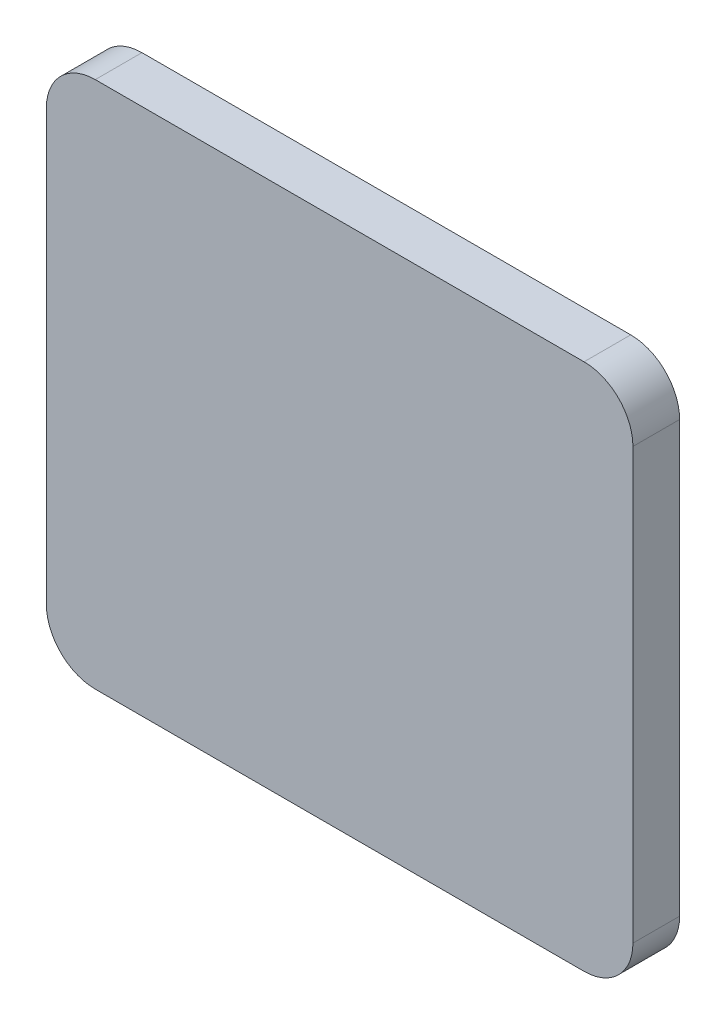
ISO-10303-21;
HEADER;
FILE_DESCRIPTION(('STEP AP214'),'2;1');
FILE_NAME('part.step','',(''),(''),'','','');
FILE_SCHEMA(('AUTOMOTIVE_DESIGN { 1 0 10303 214 1 1 1 1 }'));
ENDSEC;
DATA;
#1=APPLICATION_CONTEXT('core data for automotive mechanical design processes');
#2=APPLICATION_PROTOCOL_DEFINITION('international standard','automotive_design',2000,#1);
#3=PRODUCT_CONTEXT('',#1,'mechanical');
#4=PRODUCT('Part','Part','',(#3));
#5=PRODUCT_RELATED_PRODUCT_CATEGORY('part','',(#4));
#6=PRODUCT_DEFINITION_FORMATION('','',#4);
#7=PRODUCT_DEFINITION_CONTEXT('part definition',#1,'design');
#8=PRODUCT_DEFINITION('design','',#6,#7);
#9=PRODUCT_DEFINITION_SHAPE('','',#8);
#10=(LENGTH_UNIT() NAMED_UNIT(*) SI_UNIT(.MILLI.,.METRE.));
#11=(NAMED_UNIT(*) PLANE_ANGLE_UNIT() SI_UNIT($,.RADIAN.));
#12=(NAMED_UNIT(*) SI_UNIT($,.STERADIAN.) SOLID_ANGLE_UNIT());
#13=UNCERTAINTY_MEASURE_WITH_UNIT(LENGTH_MEASURE(1.E-05),#10,'distance_accuracy_value','');
#14=(GEOMETRIC_REPRESENTATION_CONTEXT(3) GLOBAL_UNCERTAINTY_ASSIGNED_CONTEXT((#13)) GLOBAL_UNIT_ASSIGNED_CONTEXT((#10,
#11,#12)) REPRESENTATION_CONTEXT('',''));
#15=CARTESIAN_POINT('',(0.,0.,0.));
#16=DIRECTION('',(0.,0.,1.));
#17=DIRECTION('',(1.,0.,0.));
#18=AXIS2_PLACEMENT_3D('',#15,#16,#17);
#19=CARTESIAN_POINT('',(5.,49.,4.7752));
#20=DIRECTION('',(0.,0.,-1.));
#21=DIRECTION('',(-1.,0.,0.));
#22=AXIS2_PLACEMENT_3D('',#19,#20,#21);
#23=CYLINDRICAL_SURFACE('',#22,5.);
#24=CARTESIAN_POINT('',(5.,49.,0.));
#25=DIRECTION('',(0.,0.,1.));
#26=DIRECTION('',(-1.,0.,0.));
#27=AXIS2_PLACEMENT_3D('',#24,#25,#26);
#28=CIRCLE('',#27,5.);
#29=CARTESIAN_POINT('',(5.,54.,0.));
#30=VERTEX_POINT('',#29);
#31=CARTESIAN_POINT('',(0.,49.,0.));
#32=VERTEX_POINT('',#31);
#33=EDGE_CURVE('E213',#30,#32,#28,.T.);
#34=ORIENTED_EDGE('',*,*,#33,.T.);
#35=DIRECTION('',(0.,0.,-1.));
#36=VECTOR('',#35,1.);
#37=CARTESIAN_POINT('',(0.,49.,4.7752));
#38=LINE('',#37,#36);
#39=CARTESIAN_POINT('',(0.,49.,4.7752));
#40=VERTEX_POINT('',#39);
#41=EDGE_CURVE('E12',#40,#32,#38,.T.);
#42=ORIENTED_EDGE('',*,*,#41,.F.);
#43=CARTESIAN_POINT('',(5.,49.,4.7752));
#44=DIRECTION('',(0.,0.,1.));
#45=DIRECTION('',(-1.,0.,0.));
#46=AXIS2_PLACEMENT_3D('',#43,#44,#45);
#47=CIRCLE('',#46,5.);
#48=CARTESIAN_POINT('',(5.,54.,4.7752));
#49=VERTEX_POINT('',#48);
#50=EDGE_CURVE('E167',#49,#40,#47,.T.);
#51=ORIENTED_EDGE('',*,*,#50,.F.);
#52=DIRECTION('',(0.,0.,-1.));
#53=VECTOR('',#52,1.);
#54=CARTESIAN_POINT('',(5.,54.,4.7752));
#55=LINE('',#54,#53);
#56=EDGE_CURVE('E142',#49,#30,#55,.T.);
#57=ORIENTED_EDGE('',*,*,#56,.T.);
#58=EDGE_LOOP('',(#34,#42,#51,#57));
#59=FACE_BOUND('',#58,.T.);
#60=ADVANCED_FACE('F45',(#59),#23,.T.);
#61=CARTESIAN_POINT('',(0.,5.00000000000004,4.7752));
#62=DIRECTION('',(1.,0.,0.));
#63=DIRECTION('',(0.,0.,-1.));
#64=AXIS2_PLACEMENT_3D('',#61,#62,#63);
#65=PLANE('',#64);
#66=DIRECTION('',(0.,-1.,0.));
#67=VECTOR('',#66,1.);
#68=CARTESIAN_POINT('',(0.,5.00000000000004,0.));
#69=LINE('',#68,#67);
#70=CARTESIAN_POINT('',(0.,5.00000000000004,0.));
#71=VERTEX_POINT('',#70);
#72=EDGE_CURVE('E204',#32,#71,#69,.T.);
#73=ORIENTED_EDGE('',*,*,#72,.T.);
#74=DIRECTION('',(0.,0.,-1.));
#75=VECTOR('',#74,1.);
#76=CARTESIAN_POINT('',(0.,5.00000000000004,4.7752));
#77=LINE('',#76,#75);
#78=CARTESIAN_POINT('',(0.,5.00000000000004,4.7752));
#79=VERTEX_POINT('',#78);
#80=EDGE_CURVE('E54',#79,#71,#77,.T.);
#81=ORIENTED_EDGE('',*,*,#80,.F.);
#82=DIRECTION('',(0.,-1.,0.));
#83=VECTOR('',#82,1.);
#84=CARTESIAN_POINT('',(0.,5.00000000000004,4.7752));
#85=LINE('',#84,#83);
#86=EDGE_CURVE('E105',#40,#79,#85,.T.);
#87=ORIENTED_EDGE('',*,*,#86,.F.);
#88=ORIENTED_EDGE('',*,*,#41,.T.);
#89=EDGE_LOOP('',(#73,#81,#87,#88));
#90=FACE_BOUND('',#89,.T.);
#91=ADVANCED_FACE('F235',(#90),#65,.F.);
#92=CARTESIAN_POINT('',(5.,5.,4.7752));
#93=DIRECTION('',(0.,0.,-1.));
#94=DIRECTION('',(-1.,0.,0.));
#95=AXIS2_PLACEMENT_3D('',#92,#93,#94);
#96=CYLINDRICAL_SURFACE('',#95,5.);
#97=CARTESIAN_POINT('',(5.,5.,0.));
#98=DIRECTION('',(0.,0.,1.));
#99=DIRECTION('',(1.,0.,0.));
#100=AXIS2_PLACEMENT_3D('',#97,#98,#99);
#101=CIRCLE('',#100,5.);
#102=CARTESIAN_POINT('',(5.00000000000003,0.,0.));
#103=VERTEX_POINT('',#102);
#104=EDGE_CURVE('E199',#71,#103,#101,.T.);
#105=ORIENTED_EDGE('',*,*,#104,.T.);
#106=DIRECTION('',(0.,0.,-1.));
#107=VECTOR('',#106,1.);
#108=CARTESIAN_POINT('',(5.00000000000003,0.,4.7752));
#109=LINE('',#108,#107);
#110=CARTESIAN_POINT('',(5.00000000000003,0.,4.7752));
#111=VERTEX_POINT('',#110);
#112=EDGE_CURVE('E189',#111,#103,#109,.T.);
#113=ORIENTED_EDGE('',*,*,#112,.F.);
#114=CARTESIAN_POINT('',(5.,5.,4.7752));
#115=DIRECTION('',(0.,0.,1.));
#116=DIRECTION('',(1.,0.,0.));
#117=AXIS2_PLACEMENT_3D('',#114,#115,#116);
#118=CIRCLE('',#117,5.);
#119=EDGE_CURVE('E159',#79,#111,#118,.T.);
#120=ORIENTED_EDGE('',*,*,#119,.F.);
#121=ORIENTED_EDGE('',*,*,#80,.T.);
#122=EDGE_LOOP('',(#105,#113,#120,#121));
#123=FACE_BOUND('',#122,.T.);
#124=ADVANCED_FACE('F197',(#123),#96,.T.);
#125=CARTESIAN_POINT('',(5.00000000000004,0.,4.7752));
#126=DIRECTION('',(0.,1.,0.));
#127=DIRECTION('',(0.,0.,1.));
#128=AXIS2_PLACEMENT_3D('',#125,#126,#127);
#129=PLANE('',#128);
#130=DIRECTION('',(1.,0.,0.));
#131=VECTOR('',#130,1.);
#132=CARTESIAN_POINT('',(5.00000000000004,0.,0.));
#133=LINE('',#132,#131);
#134=CARTESIAN_POINT('',(55.,0.,0.));
#135=VERTEX_POINT('',#134);
#136=EDGE_CURVE('E206',#103,#135,#133,.T.);
#137=ORIENTED_EDGE('',*,*,#136,.T.);
#138=DIRECTION('',(0.,0.,-1.));
#139=VECTOR('',#138,1.);
#140=CARTESIAN_POINT('',(55.,0.,4.7752));
#141=LINE('',#140,#139);
#142=CARTESIAN_POINT('',(55.,0.,4.7752));
#143=VERTEX_POINT('',#142);
#144=EDGE_CURVE('E185',#143,#135,#141,.T.);
#145=ORIENTED_EDGE('',*,*,#144,.F.);
#146=DIRECTION('',(1.,0.,0.));
#147=VECTOR('',#146,1.);
#148=CARTESIAN_POINT('',(5.00000000000004,0.,4.7752));
#149=LINE('',#148,#147);
#150=EDGE_CURVE('E155',#111,#143,#149,.T.);
#151=ORIENTED_EDGE('',*,*,#150,.F.);
#152=ORIENTED_EDGE('',*,*,#112,.T.);
#153=EDGE_LOOP('',(#137,#145,#151,#152));
#154=FACE_BOUND('',#153,.T.);
#155=ADVANCED_FACE('F242',(#154),#129,.F.);
#156=CARTESIAN_POINT('',(55.,5.,4.7752));
#157=DIRECTION('',(0.,0.,-1.));
#158=DIRECTION('',(-1.,0.,0.));
#159=AXIS2_PLACEMENT_3D('',#156,#157,#158);
#160=CYLINDRICAL_SURFACE('',#159,5.);
#161=CARTESIAN_POINT('',(55.,5.,0.));
#162=DIRECTION('',(0.,0.,1.));
#163=DIRECTION('',(1.,0.,0.));
#164=AXIS2_PLACEMENT_3D('',#161,#162,#163);
#165=CIRCLE('',#164,5.);
#166=CARTESIAN_POINT('',(60.,5.,0.));
#167=VERTEX_POINT('',#166);
#168=EDGE_CURVE('E211',#135,#167,#165,.T.);
#169=ORIENTED_EDGE('',*,*,#168,.T.);
#170=DIRECTION('',(0.,0.,-1.));
#171=VECTOR('',#170,1.);
#172=CARTESIAN_POINT('',(60.,5.,4.7752));
#173=LINE('',#172,#171);
#174=CARTESIAN_POINT('',(60.,5.,4.7752));
#175=VERTEX_POINT('',#174);
#176=EDGE_CURVE('E135',#175,#167,#173,.T.);
#177=ORIENTED_EDGE('',*,*,#176,.F.);
#178=CARTESIAN_POINT('',(55.,5.,4.7752));
#179=DIRECTION('',(0.,0.,1.));
#180=DIRECTION('',(1.,0.,0.));
#181=AXIS2_PLACEMENT_3D('',#178,#179,#180);
#182=CIRCLE('',#181,5.);
#183=EDGE_CURVE('E124',#143,#175,#182,.T.);
#184=ORIENTED_EDGE('',*,*,#183,.F.);
#185=ORIENTED_EDGE('',*,*,#144,.T.);
#186=EDGE_LOOP('',(#169,#177,#184,#185));
#187=FACE_BOUND('',#186,.T.);
#188=ADVANCED_FACE('F219',(#187),#160,.T.);
#189=CARTESIAN_POINT('',(60.,49.,4.7752));
#190=DIRECTION('',(-1.,0.,0.));
#191=DIRECTION('',(0.,-1.,0.));
#192=AXIS2_PLACEMENT_3D('',#189,#190,#191);
#193=PLANE('',#192);
#194=DIRECTION('',(0.,1.,0.));
#195=VECTOR('',#194,1.);
#196=CARTESIAN_POINT('',(60.,49.,0.));
#197=LINE('',#196,#195);
#198=CARTESIAN_POINT('',(60.,49.,0.));
#199=VERTEX_POINT('',#198);
#200=EDGE_CURVE('E133',#167,#199,#197,.T.);
#201=ORIENTED_EDGE('',*,*,#200,.T.);
#202=DIRECTION('',(0.,0.,-1.));
#203=VECTOR('',#202,1.);
#204=CARTESIAN_POINT('',(60.,49.,4.7752));
#205=LINE('',#204,#203);
#206=CARTESIAN_POINT('',(60.,49.,4.7752));
#207=VERTEX_POINT('',#206);
#208=EDGE_CURVE('E130',#207,#199,#205,.T.);
#209=ORIENTED_EDGE('',*,*,#208,.F.);
#210=DIRECTION('',(0.,1.,0.));
#211=VECTOR('',#210,1.);
#212=CARTESIAN_POINT('',(60.,49.,4.7752));
#213=LINE('',#212,#211);
#214=EDGE_CURVE('E118',#175,#207,#213,.T.);
#215=ORIENTED_EDGE('',*,*,#214,.F.);
#216=ORIENTED_EDGE('',*,*,#176,.T.);
#217=EDGE_LOOP('',(#201,#209,#215,#216));
#218=FACE_BOUND('',#217,.T.);
#219=ADVANCED_FACE('F131',(#218),#193,.F.);
#220=CARTESIAN_POINT('',(55.,49.,4.7752));
#221=DIRECTION('',(0.,0.,-1.));
#222=DIRECTION('',(-1.,0.,0.));
#223=AXIS2_PLACEMENT_3D('',#220,#221,#222);
#224=CYLINDRICAL_SURFACE('',#223,5.);
#225=CARTESIAN_POINT('',(55.,49.,0.));
#226=DIRECTION('',(0.,0.,1.));
#227=DIRECTION('',(-1.,0.,0.));
#228=AXIS2_PLACEMENT_3D('',#225,#226,#227);
#229=CIRCLE('',#228,5.);
#230=CARTESIAN_POINT('',(55.,54.,0.));
#231=VERTEX_POINT('',#230);
#232=EDGE_CURVE('E91',#199,#231,#229,.T.);
#233=ORIENTED_EDGE('',*,*,#232,.T.);
#234=DIRECTION('',(0.,0.,-1.));
#235=VECTOR('',#234,1.);
#236=CARTESIAN_POINT('',(55.,54.,4.7752));
#237=LINE('',#236,#235);
#238=CARTESIAN_POINT('',(55.,54.,4.7752));
#239=VERTEX_POINT('',#238);
#240=EDGE_CURVE('E136',#239,#231,#237,.T.);
#241=ORIENTED_EDGE('',*,*,#240,.F.);
#242=CARTESIAN_POINT('',(55.,49.,4.7752));
#243=DIRECTION('',(0.,0.,1.));
#244=DIRECTION('',(-1.,0.,0.));
#245=AXIS2_PLACEMENT_3D('',#242,#243,#244);
#246=CIRCLE('',#245,5.);
#247=EDGE_CURVE('E122',#207,#239,#246,.T.);
#248=ORIENTED_EDGE('',*,*,#247,.F.);
#249=ORIENTED_EDGE('',*,*,#208,.T.);
#250=EDGE_LOOP('',(#233,#241,#248,#249));
#251=FACE_BOUND('',#250,.T.);
#252=ADVANCED_FACE('F138',(#251),#224,.T.);
#253=CARTESIAN_POINT('',(5.,54.,4.7752));
#254=DIRECTION('',(0.,-1.,0.));
#255=DIRECTION('',(0.,0.,-1.));
#256=AXIS2_PLACEMENT_3D('',#253,#254,#255);
#257=PLANE('',#256);
#258=DIRECTION('',(-1.,0.,0.));
#259=VECTOR('',#258,1.);
#260=CARTESIAN_POINT('',(5.,54.,0.));
#261=LINE('',#260,#259);
#262=EDGE_CURVE('E97',#231,#30,#261,.T.);
#263=ORIENTED_EDGE('',*,*,#262,.T.);
#264=ORIENTED_EDGE('',*,*,#56,.F.);
#265=DIRECTION('',(-1.,0.,0.));
#266=VECTOR('',#265,1.);
#267=CARTESIAN_POINT('',(5.,54.,4.7752));
#268=LINE('',#267,#266);
#269=EDGE_CURVE('E62',#239,#49,#268,.T.);
#270=ORIENTED_EDGE('',*,*,#269,.F.);
#271=ORIENTED_EDGE('',*,*,#240,.T.);
#272=EDGE_LOOP('',(#263,#264,#270,#271));
#273=FACE_BOUND('',#272,.T.);
#274=ADVANCED_FACE('F224',(#273),#257,.F.);
#275=CARTESIAN_POINT('',(5.,49.,4.7752));
#276=DIRECTION('',(0.,0.,-1.));
#277=DIRECTION('',(-1.,0.,0.));
#278=AXIS2_PLACEMENT_3D('',#275,#276,#277);
#279=PLANE('',#278);
#280=ORIENTED_EDGE('',*,*,#50,.T.);
#281=ORIENTED_EDGE('',*,*,#86,.T.);
#282=ORIENTED_EDGE('',*,*,#119,.T.);
#283=ORIENTED_EDGE('',*,*,#150,.T.);
#284=ORIENTED_EDGE('',*,*,#183,.T.);
#285=ORIENTED_EDGE('',*,*,#214,.T.);
#286=ORIENTED_EDGE('',*,*,#247,.T.);
#287=ORIENTED_EDGE('',*,*,#269,.T.);
#288=EDGE_LOOP('',(#280,#281,#282,#283,#284,#285,#286,#287));
#289=FACE_BOUND('',#288,.T.);
#290=ADVANCED_FACE('F120',(#289),#279,.F.);
#291=CARTESIAN_POINT('',(5.,49.,0.));
#292=DIRECTION('',(0.,0.,-1.));
#293=DIRECTION('',(-1.,0.,0.));
#294=AXIS2_PLACEMENT_3D('',#291,#292,#293);
#295=PLANE('',#294);
#296=ORIENTED_EDGE('',*,*,#33,.F.);
#297=ORIENTED_EDGE('',*,*,#262,.F.);
#298=ORIENTED_EDGE('',*,*,#232,.F.);
#299=ORIENTED_EDGE('',*,*,#200,.F.);
#300=ORIENTED_EDGE('',*,*,#168,.F.);
#301=ORIENTED_EDGE('',*,*,#136,.F.);
#302=ORIENTED_EDGE('',*,*,#104,.F.);
#303=ORIENTED_EDGE('',*,*,#72,.F.);
#304=EDGE_LOOP('',(#296,#297,#298,#299,#300,#301,#302,#303));
#305=FACE_BOUND('',#304,.T.);
#306=ADVANCED_FACE('F203',(#305),#295,.T.);
#307=CLOSED_SHELL('',(#60,#91,#124,#155,#188,#219,#252,#274,#290,#306));
#308=MANIFOLD_SOLID_BREP('B2',#307);
#309=ADVANCED_BREP_SHAPE_REPRESENTATION('',(#18,#308),#14);
#310=SHAPE_DEFINITION_REPRESENTATION(#9,#309);
ENDSEC;
END-ISO-10303-21;
